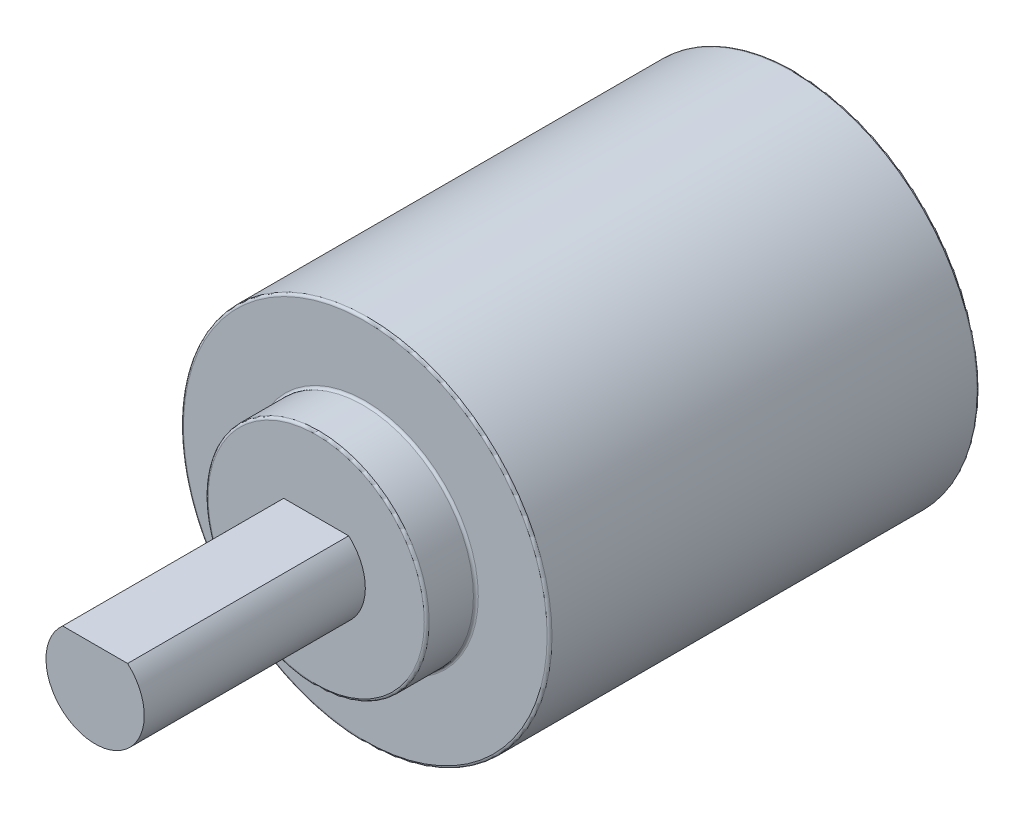
ISO-10303-21;
HEADER;
FILE_DESCRIPTION(('STEP AP214'),'2;1');
FILE_NAME('part.step','',(''),(''),'','','');
FILE_SCHEMA(('AUTOMOTIVE_DESIGN { 1 0 10303 214 1 1 1 1 }'));
ENDSEC;
DATA;
#1=APPLICATION_CONTEXT('core data for automotive mechanical design processes');
#2=APPLICATION_PROTOCOL_DEFINITION('international standard','automotive_design',2000,#1);
#3=PRODUCT_CONTEXT('',#1,'mechanical');
#4=PRODUCT('Part','Part','',(#3));
#5=PRODUCT_RELATED_PRODUCT_CATEGORY('part','',(#4));
#6=PRODUCT_DEFINITION_FORMATION('','',#4);
#7=PRODUCT_DEFINITION_CONTEXT('part definition',#1,'design');
#8=PRODUCT_DEFINITION('design','',#6,#7);
#9=PRODUCT_DEFINITION_SHAPE('','',#8);
#10=(LENGTH_UNIT() NAMED_UNIT(*) SI_UNIT(.MILLI.,.METRE.));
#11=(NAMED_UNIT(*) PLANE_ANGLE_UNIT() SI_UNIT($,.RADIAN.));
#12=(NAMED_UNIT(*) SI_UNIT($,.STERADIAN.) SOLID_ANGLE_UNIT());
#13=UNCERTAINTY_MEASURE_WITH_UNIT(LENGTH_MEASURE(1.E-05),#10,'distance_accuracy_value','');
#14=(GEOMETRIC_REPRESENTATION_CONTEXT(3) GLOBAL_UNCERTAINTY_ASSIGNED_CONTEXT((#13)) GLOBAL_UNIT_ASSIGNED_CONTEXT((#10,
#11,#12)) REPRESENTATION_CONTEXT('',''));
#15=CARTESIAN_POINT('',(0.,0.,0.));
#16=DIRECTION('',(0.,0.,1.));
#17=DIRECTION('',(1.,0.,0.));
#18=AXIS2_PLACEMENT_3D('',#15,#16,#17);
#19=CARTESIAN_POINT('',(0.,0.,39.));
#20=DIRECTION('',(0.,0.,1.));
#21=DIRECTION('',(1.,0.,0.));
#22=AXIS2_PLACEMENT_3D('',#19,#20,#21);
#23=PLANE('',#22);
#24=CARTESIAN_POINT('',(0.,0.,39.));
#25=DIRECTION('',(0.,0.,1.));
#26=DIRECTION('',(1.,0.,0.));
#27=AXIS2_PLACEMENT_3D('',#24,#25,#26);
#28=CIRCLE('',#27,8.8);
#29=CARTESIAN_POINT('',(8.8,0.,39.));
#30=VERTEX_POINT('',#29);
#31=EDGE_CURVE('E80',#30,#30,#28,.T.);
#32=ORIENTED_EDGE('',*,*,#31,.T.);
#33=EDGE_LOOP('',(#32));
#34=FACE_BOUND('',#33,.T.);
#35=DIRECTION('',(1.,0.,0.));
#36=VECTOR('',#35,1.);
#37=CARTESIAN_POINT('',(0.,3.,39.));
#38=LINE('',#37,#36);
#39=CARTESIAN_POINT('',(-2.64575131106459,3.,39.));
#40=VERTEX_POINT('',#39);
#41=CARTESIAN_POINT('',(2.64575131106459,3.,39.));
#42=VERTEX_POINT('',#41);
#43=EDGE_CURVE('E50',#40,#42,#38,.T.);
#44=ORIENTED_EDGE('',*,*,#43,.T.);
#45=CARTESIAN_POINT('',(0.,0.,39.));
#46=DIRECTION('',(0.,0.,1.));
#47=DIRECTION('',(1.,0.,0.));
#48=AXIS2_PLACEMENT_3D('',#45,#46,#47);
#49=CIRCLE('',#48,4.);
#50=EDGE_CURVE('E71',#40,#42,#49,.T.);
#51=ORIENTED_EDGE('',*,*,#50,.F.);
#52=EDGE_LOOP('',(#44,#51));
#53=FACE_BOUND('',#52,.T.);
#54=ADVANCED_FACE('F35',(#34,#53),#23,.T.);
#55=CARTESIAN_POINT('',(0.,0.,35.));
#56=DIRECTION('',(0.,0.,-1.));
#57=DIRECTION('',(-1.,0.,0.));
#58=AXIS2_PLACEMENT_3D('',#55,#56,#57);
#59=CYLINDRICAL_SURFACE('',#58,15.);
#60=CARTESIAN_POINT('',(0.,0.,34.8));
#61=DIRECTION('',(0.,0.,1.));
#62=DIRECTION('',(1.,0.,0.));
#63=AXIS2_PLACEMENT_3D('',#60,#61,#62);
#64=CIRCLE('',#63,15.);
#65=CARTESIAN_POINT('',(15.,0.,34.8));
#66=VERTEX_POINT('',#65);
#67=EDGE_CURVE('E98',#66,#66,#64,.F.);
#68=ORIENTED_EDGE('',*,*,#67,.T.);
#69=EDGE_LOOP('',(#68));
#70=FACE_BOUND('',#69,.T.);
#71=CARTESIAN_POINT('',(0.,0.,0.199999999999999));
#72=DIRECTION('',(0.,0.,1.));
#73=DIRECTION('',(1.,0.,0.));
#74=AXIS2_PLACEMENT_3D('',#71,#72,#73);
#75=CIRCLE('',#74,15.);
#76=CARTESIAN_POINT('',(15.,0.,0.199999999999999));
#77=VERTEX_POINT('',#76);
#78=EDGE_CURVE('E95',#77,#77,#75,.T.);
#79=ORIENTED_EDGE('',*,*,#78,.T.);
#80=EDGE_LOOP('',(#79));
#81=FACE_BOUND('',#80,.T.);
#82=ADVANCED_FACE('F124',(#70,#81),#59,.T.);
#83=CARTESIAN_POINT('',(0.,0.,35.));
#84=DIRECTION('',(0.,0.,1.));
#85=DIRECTION('',(1.,0.,0.));
#86=AXIS2_PLACEMENT_3D('',#83,#84,#85);
#87=PLANE('',#86);
#88=CARTESIAN_POINT('',(0.,0.,35.));
#89=DIRECTION('',(0.,0.,1.));
#90=DIRECTION('',(1.,0.,0.));
#91=AXIS2_PLACEMENT_3D('',#88,#89,#90);
#92=CIRCLE('',#91,14.8);
#93=CARTESIAN_POINT('',(14.8,0.,35.));
#94=VERTEX_POINT('',#93);
#95=EDGE_CURVE('E92',#94,#94,#92,.T.);
#96=ORIENTED_EDGE('',*,*,#95,.T.);
#97=EDGE_LOOP('',(#96));
#98=FACE_BOUND('',#97,.T.);
#99=CARTESIAN_POINT('',(0.,0.,35.));
#100=DIRECTION('',(0.,0.,1.));
#101=DIRECTION('',(1.,0.,0.));
#102=AXIS2_PLACEMENT_3D('',#99,#100,#101);
#103=CIRCLE('',#102,9.2);
#104=CARTESIAN_POINT('',(9.2,0.,35.));
#105=VERTEX_POINT('',#104);
#106=EDGE_CURVE('E89',#105,#105,#103,.F.);
#107=ORIENTED_EDGE('',*,*,#106,.T.);
#108=EDGE_LOOP('',(#107));
#109=FACE_BOUND('',#108,.T.);
#110=ADVANCED_FACE('F130',(#98,#109),#87,.T.);
#111=CARTESIAN_POINT('',(0.,0.,0.));
#112=DIRECTION('',(0.,0.,1.));
#113=DIRECTION('',(1.,0.,0.));
#114=AXIS2_PLACEMENT_3D('',#111,#112,#113);
#115=PLANE('',#114);
#116=CARTESIAN_POINT('',(0.,0.,0.));
#117=DIRECTION('',(0.,0.,1.));
#118=DIRECTION('',(1.,0.,0.));
#119=AXIS2_PLACEMENT_3D('',#116,#117,#118);
#120=CIRCLE('',#119,14.8);
#121=CARTESIAN_POINT('',(14.8,0.,0.));
#122=VERTEX_POINT('',#121);
#123=EDGE_CURVE('E104',#122,#122,#120,.F.);
#124=ORIENTED_EDGE('',*,*,#123,.T.);
#125=EDGE_LOOP('',(#124));
#126=FACE_BOUND('',#125,.T.);
#127=CARTESIAN_POINT('',(0.,0.,0.));
#128=DIRECTION('',(0.,0.,1.));
#129=DIRECTION('',(1.,0.,0.));
#130=AXIS2_PLACEMENT_3D('',#127,#128,#129);
#131=CIRCLE('',#130,10.2);
#132=CARTESIAN_POINT('',(10.2,0.,0.));
#133=VERTEX_POINT('',#132);
#134=EDGE_CURVE('E101',#133,#133,#131,.T.);
#135=ORIENTED_EDGE('',*,*,#134,.T.);
#136=EDGE_LOOP('',(#135));
#137=FACE_BOUND('',#136,.T.);
#138=ADVANCED_FACE('F139',(#126,#137),#115,.F.);
#139=CARTESIAN_POINT('',(0.,0.,39.));
#140=DIRECTION('',(0.,0.,-1.));
#141=DIRECTION('',(-1.,0.,0.));
#142=AXIS2_PLACEMENT_3D('',#139,#140,#141);
#143=CYLINDRICAL_SURFACE('',#142,9.);
#144=CARTESIAN_POINT('',(0.,0.,38.8));
#145=DIRECTION('',(0.,0.,1.));
#146=DIRECTION('',(1.,0.,0.));
#147=AXIS2_PLACEMENT_3D('',#144,#145,#146);
#148=CIRCLE('',#147,9.);
#149=CARTESIAN_POINT('',(9.,0.,38.8));
#150=VERTEX_POINT('',#149);
#151=EDGE_CURVE('E86',#150,#150,#148,.F.);
#152=ORIENTED_EDGE('',*,*,#151,.T.);
#153=EDGE_LOOP('',(#152));
#154=FACE_BOUND('',#153,.T.);
#155=CARTESIAN_POINT('',(0.,0.,35.2));
#156=DIRECTION('',(0.,0.,1.));
#157=DIRECTION('',(1.,0.,0.));
#158=AXIS2_PLACEMENT_3D('',#155,#156,#157);
#159=CIRCLE('',#158,9.);
#160=CARTESIAN_POINT('',(9.,0.,35.2));
#161=VERTEX_POINT('',#160);
#162=EDGE_CURVE('E83',#161,#161,#159,.T.);
#163=ORIENTED_EDGE('',*,*,#162,.T.);
#164=EDGE_LOOP('',(#163));
#165=FACE_BOUND('',#164,.T.);
#166=ADVANCED_FACE('F136',(#154,#165),#143,.T.);
#167=CARTESIAN_POINT('',(0.,3.,57.));
#168=DIRECTION('',(0.,1.,0.));
#169=DIRECTION('',(0.,0.,1.));
#170=AXIS2_PLACEMENT_3D('',#167,#168,#169);
#171=PLANE('',#170);
#172=ORIENTED_EDGE('',*,*,#43,.F.);
#173=DIRECTION('',(0.,0.,-1.));
#174=VECTOR('',#173,1.);
#175=CARTESIAN_POINT('',(-2.64575131106459,3.,57.));
#176=LINE('',#175,#174);
#177=CARTESIAN_POINT('',(-2.64575131106459,3.,57.));
#178=VERTEX_POINT('',#177);
#179=EDGE_CURVE('E68',#178,#40,#176,.T.);
#180=ORIENTED_EDGE('',*,*,#179,.F.);
#181=DIRECTION('',(1.,0.,0.));
#182=VECTOR('',#181,1.);
#183=CARTESIAN_POINT('',(0.,3.,57.));
#184=LINE('',#183,#182);
#185=CARTESIAN_POINT('',(2.64575131106459,3.,57.));
#186=VERTEX_POINT('',#185);
#187=EDGE_CURVE('E66',#178,#186,#184,.T.);
#188=ORIENTED_EDGE('',*,*,#187,.T.);
#189=DIRECTION('',(0.,0.,-1.));
#190=VECTOR('',#189,1.);
#191=CARTESIAN_POINT('',(2.64575131106459,3.,57.));
#192=LINE('',#191,#190);
#193=EDGE_CURVE('E63',#186,#42,#192,.T.);
#194=ORIENTED_EDGE('',*,*,#193,.T.);
#195=EDGE_LOOP('',(#172,#180,#188,#194));
#196=FACE_BOUND('',#195,.T.);
#197=ADVANCED_FACE('F65',(#196),#171,.T.);
#198=CARTESIAN_POINT('',(0.,0.,57.));
#199=DIRECTION('',(0.,0.,-1.));
#200=DIRECTION('',(-1.,0.,0.));
#201=AXIS2_PLACEMENT_3D('',#198,#199,#200);
#202=CYLINDRICAL_SURFACE('',#201,4.);
#203=ORIENTED_EDGE('',*,*,#50,.T.);
#204=ORIENTED_EDGE('',*,*,#193,.F.);
#205=CARTESIAN_POINT('',(0.,0.,57.));
#206=DIRECTION('',(0.,0.,1.));
#207=DIRECTION('',(1.,0.,0.));
#208=AXIS2_PLACEMENT_3D('',#205,#206,#207);
#209=CIRCLE('',#208,4.);
#210=EDGE_CURVE('E58',#178,#186,#209,.T.);
#211=ORIENTED_EDGE('',*,*,#210,.F.);
#212=ORIENTED_EDGE('',*,*,#179,.T.);
#213=EDGE_LOOP('',(#203,#204,#211,#212));
#214=FACE_BOUND('',#213,.T.);
#215=ADVANCED_FACE('F72',(#214),#202,.T.);
#216=CARTESIAN_POINT('',(0.,0.,57.));
#217=DIRECTION('',(0.,0.,1.));
#218=DIRECTION('',(1.,0.,0.));
#219=AXIS2_PLACEMENT_3D('',#216,#217,#218);
#220=PLANE('',#219);
#221=ORIENTED_EDGE('',*,*,#187,.F.);
#222=ORIENTED_EDGE('',*,*,#210,.T.);
#223=EDGE_LOOP('',(#221,#222));
#224=FACE_BOUND('',#223,.T.);
#225=ADVANCED_FACE('F174',(#224),#220,.T.);
#226=CARTESIAN_POINT('',(0.,0.,18.));
#227=DIRECTION('',(0.,0.,-1.));
#228=DIRECTION('',(-1.,0.,0.));
#229=AXIS2_PLACEMENT_3D('',#226,#227,#228);
#230=CYLINDRICAL_SURFACE('',#229,10.);
#231=CARTESIAN_POINT('',(0.,0.,17.5));
#232=DIRECTION('',(0.,0.,-1.));
#233=DIRECTION('',(-1.,0.,0.));
#234=AXIS2_PLACEMENT_3D('',#231,#232,#233);
#235=CIRCLE('',#234,10.);
#236=CARTESIAN_POINT('',(-10.,0.,17.5));
#237=VERTEX_POINT('',#236);
#238=EDGE_CURVE('E11',#237,#237,#235,.F.);
#239=ORIENTED_EDGE('',*,*,#238,.T.);
#240=EDGE_LOOP('',(#239));
#241=FACE_BOUND('',#240,.T.);
#242=CARTESIAN_POINT('',(0.,0.,0.199999999999999));
#243=DIRECTION('',(0.,0.,1.));
#244=DIRECTION('',(1.,0.,0.));
#245=AXIS2_PLACEMENT_3D('',#242,#243,#244);
#246=CIRCLE('',#245,10.);
#247=CARTESIAN_POINT('',(10.,0.,0.199999999999999));
#248=VERTEX_POINT('',#247);
#249=EDGE_CURVE('E107',#248,#248,#246,.F.);
#250=ORIENTED_EDGE('',*,*,#249,.T.);
#251=EDGE_LOOP('',(#250));
#252=FACE_BOUND('',#251,.T.);
#253=ADVANCED_FACE('F172',(#241,#252),#230,.F.);
#254=CARTESIAN_POINT('',(0.,0.,18.));
#255=DIRECTION('',(0.,0.,-1.));
#256=DIRECTION('',(-1.,0.,0.));
#257=AXIS2_PLACEMENT_3D('',#254,#255,#256);
#258=PLANE('',#257);
#259=CARTESIAN_POINT('',(0.,0.,18.));
#260=DIRECTION('',(0.,0.,-1.));
#261=DIRECTION('',(-1.,0.,0.));
#262=AXIS2_PLACEMENT_3D('',#259,#260,#261);
#263=CIRCLE('',#262,9.5);
#264=CARTESIAN_POINT('',(-9.5,0.,18.));
#265=VERTEX_POINT('',#264);
#266=EDGE_CURVE('E43',#265,#265,#263,.T.);
#267=ORIENTED_EDGE('',*,*,#266,.T.);
#268=EDGE_LOOP('',(#267));
#269=FACE_BOUND('',#268,.T.);
#270=ADVANCED_FACE('F112',(#269),#258,.T.);
#271=CARTESIAN_POINT('',(0.,0.,38.8));
#272=DIRECTION('',(0.,0.,1.));
#273=DIRECTION('',(1.,0.,0.));
#274=AXIS2_PLACEMENT_3D('',#271,#272,#273);
#275=TOROIDAL_SURFACE('',#274,8.8,0.2);
#276=ORIENTED_EDGE('',*,*,#151,.F.);
#277=EDGE_LOOP('',(#276));
#278=FACE_BOUND('',#277,.T.);
#279=ORIENTED_EDGE('',*,*,#31,.F.);
#280=EDGE_LOOP('',(#279));
#281=FACE_BOUND('',#280,.T.);
#282=ADVANCED_FACE('F147',(#278,#281),#275,.T.);
#283=CARTESIAN_POINT('',(0.,0.,34.8));
#284=DIRECTION('',(0.,0.,1.));
#285=DIRECTION('',(1.,0.,0.));
#286=AXIS2_PLACEMENT_3D('',#283,#284,#285);
#287=TOROIDAL_SURFACE('',#286,14.8,0.2);
#288=ORIENTED_EDGE('',*,*,#67,.F.);
#289=EDGE_LOOP('',(#288));
#290=FACE_BOUND('',#289,.T.);
#291=ORIENTED_EDGE('',*,*,#95,.F.);
#292=EDGE_LOOP('',(#291));
#293=FACE_BOUND('',#292,.T.);
#294=ADVANCED_FACE('F150',(#290,#293),#287,.T.);
#295=CARTESIAN_POINT('',(0.,0.,35.2));
#296=DIRECTION('',(0.,0.,1.));
#297=DIRECTION('',(1.,0.,0.));
#298=AXIS2_PLACEMENT_3D('',#295,#296,#297);
#299=TOROIDAL_SURFACE('',#298,9.2,0.2);
#300=ORIENTED_EDGE('',*,*,#106,.F.);
#301=EDGE_LOOP('',(#300));
#302=FACE_BOUND('',#301,.T.);
#303=ORIENTED_EDGE('',*,*,#162,.F.);
#304=EDGE_LOOP('',(#303));
#305=FACE_BOUND('',#304,.T.);
#306=ADVANCED_FACE('F154',(#302,#305),#299,.F.);
#307=CARTESIAN_POINT('',(0.,0.,0.199999999999999));
#308=DIRECTION('',(0.,0.,1.));
#309=DIRECTION('',(1.,0.,0.));
#310=AXIS2_PLACEMENT_3D('',#307,#308,#309);
#311=TOROIDAL_SURFACE('',#310,14.8,0.2);
#312=ORIENTED_EDGE('',*,*,#123,.F.);
#313=EDGE_LOOP('',(#312));
#314=FACE_BOUND('',#313,.T.);
#315=ORIENTED_EDGE('',*,*,#78,.F.);
#316=EDGE_LOOP('',(#315));
#317=FACE_BOUND('',#316,.T.);
#318=ADVANCED_FACE('F120',(#314,#317),#311,.T.);
#319=CARTESIAN_POINT('',(0.,0.,0.199999999999999));
#320=DIRECTION('',(0.,0.,1.));
#321=DIRECTION('',(1.,0.,0.));
#322=AXIS2_PLACEMENT_3D('',#319,#320,#321);
#323=TOROIDAL_SURFACE('',#322,10.2,0.2);
#324=ORIENTED_EDGE('',*,*,#134,.F.);
#325=EDGE_LOOP('',(#324));
#326=FACE_BOUND('',#325,.T.);
#327=ORIENTED_EDGE('',*,*,#249,.F.);
#328=EDGE_LOOP('',(#327));
#329=FACE_BOUND('',#328,.T.);
#330=ADVANCED_FACE('F115',(#326,#329),#323,.T.);
#331=CARTESIAN_POINT('',(0.,0.,17.5));
#332=DIRECTION('',(0.,0.,-1.));
#333=DIRECTION('',(-1.,0.,0.));
#334=AXIS2_PLACEMENT_3D('',#331,#332,#333);
#335=TOROIDAL_SURFACE('',#334,9.5,0.5);
#336=ORIENTED_EDGE('',*,*,#238,.F.);
#337=EDGE_LOOP('',(#336));
#338=FACE_BOUND('',#337,.T.);
#339=ORIENTED_EDGE('',*,*,#266,.F.);
#340=EDGE_LOOP('',(#339));
#341=FACE_BOUND('',#340,.T.);
#342=ADVANCED_FACE('F37',(#338,#341),#335,.F.);
#343=CLOSED_SHELL('',(#54,#82,#110,#138,#166,#197,#215,#225,#253,#270,#282,#294,#306,#318,#330,#342));
#344=MANIFOLD_SOLID_BREP('B2',#343);
#345=ADVANCED_BREP_SHAPE_REPRESENTATION('',(#18,#344),#14);
#346=SHAPE_DEFINITION_REPRESENTATION(#9,#345);
ENDSEC;
END-ISO-10303-21;
